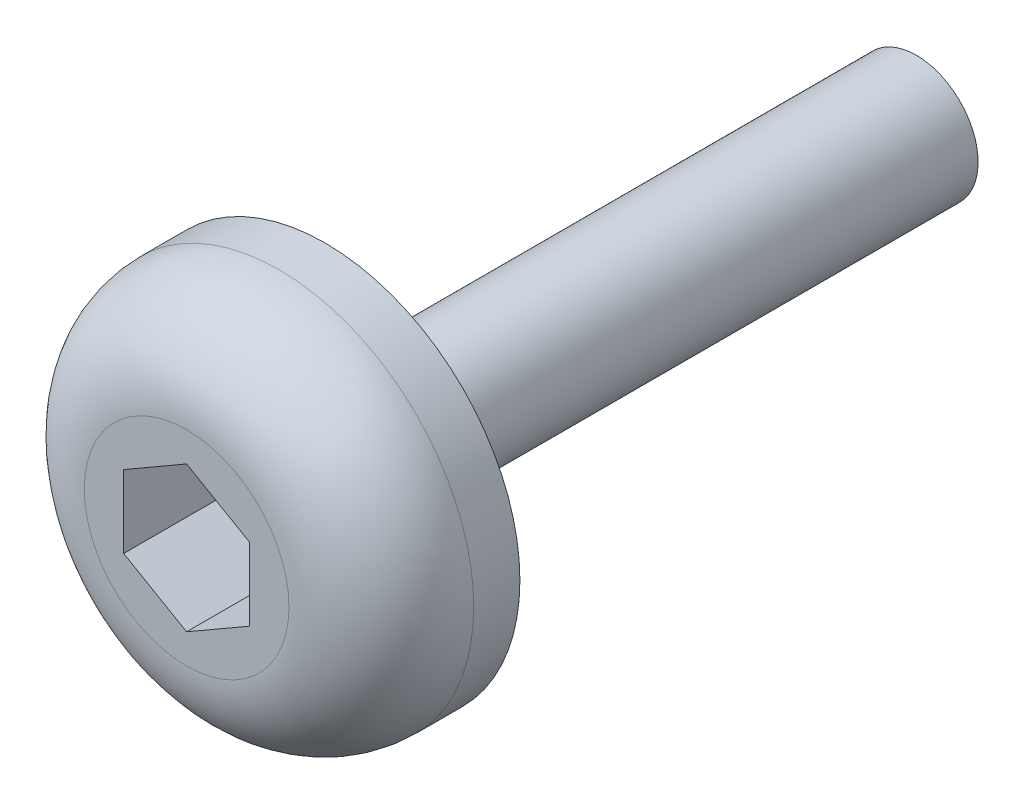
ISO-10303-21;
HEADER;
FILE_DESCRIPTION(('STEP AP214'),'2;1');
FILE_NAME('part.step','',(''),(''),'','','');
FILE_SCHEMA(('AUTOMOTIVE_DESIGN { 1 0 10303 214 1 1 1 1 }'));
ENDSEC;
DATA;
#1=APPLICATION_CONTEXT('core data for automotive mechanical design processes');
#2=APPLICATION_PROTOCOL_DEFINITION('international standard','automotive_design',2000,#1);
#3=PRODUCT_CONTEXT('',#1,'mechanical');
#4=PRODUCT('Part','Part','',(#3));
#5=PRODUCT_RELATED_PRODUCT_CATEGORY('part','',(#4));
#6=PRODUCT_DEFINITION_FORMATION('','',#4);
#7=PRODUCT_DEFINITION_CONTEXT('part definition',#1,'design');
#8=PRODUCT_DEFINITION('design','',#6,#7);
#9=PRODUCT_DEFINITION_SHAPE('','',#8);
#10=(LENGTH_UNIT() NAMED_UNIT(*) SI_UNIT(.MILLI.,.METRE.));
#11=(NAMED_UNIT(*) PLANE_ANGLE_UNIT() SI_UNIT($,.RADIAN.));
#12=(NAMED_UNIT(*) SI_UNIT($,.STERADIAN.) SOLID_ANGLE_UNIT());
#13=UNCERTAINTY_MEASURE_WITH_UNIT(LENGTH_MEASURE(1.E-05),#10,'distance_accuracy_value','');
#14=(GEOMETRIC_REPRESENTATION_CONTEXT(3) GLOBAL_UNCERTAINTY_ASSIGNED_CONTEXT((#13)) GLOBAL_UNIT_ASSIGNED_CONTEXT((#10,
#11,#12)) REPRESENTATION_CONTEXT('',''));
#15=CARTESIAN_POINT('',(0.,0.,0.));
#16=DIRECTION('',(0.,0.,1.));
#17=DIRECTION('',(1.,0.,0.));
#18=AXIS2_PLACEMENT_3D('',#15,#16,#17);
#19=CARTESIAN_POINT('',(0.,0.,3.81));
#20=DIRECTION('',(0.,0.,-1.));
#21=DIRECTION('',(-1.,0.,0.));
#22=AXIS2_PLACEMENT_3D('',#19,#20,#21);
#23=CYLINDRICAL_SURFACE('',#22,5.35434108198085);
#24=CARTESIAN_POINT('',(0.,0.,1.27));
#25=DIRECTION('',(0.,0.,1.));
#26=DIRECTION('',(1.,0.,0.));
#27=AXIS2_PLACEMENT_3D('',#24,#25,#26);
#28=CIRCLE('',#27,5.35434108198085);
#29=CARTESIAN_POINT('',(5.35434108198085,0.,1.27));
#30=VERTEX_POINT('',#29);
#31=EDGE_CURVE('E38',#30,#30,#28,.F.);
#32=ORIENTED_EDGE('',*,*,#31,.T.);
#33=EDGE_LOOP('',(#32));
#34=FACE_BOUND('',#33,.T.);
#35=CARTESIAN_POINT('',(0.,0.,0.));
#36=DIRECTION('',(0.,0.,1.));
#37=DIRECTION('',(1.,0.,0.));
#38=AXIS2_PLACEMENT_3D('',#35,#36,#37);
#39=CIRCLE('',#38,5.35434108198085);
#40=CARTESIAN_POINT('',(5.35434108198085,0.,0.));
#41=VERTEX_POINT('',#40);
#42=EDGE_CURVE('E138',#41,#41,#39,.T.);
#43=ORIENTED_EDGE('',*,*,#42,.T.);
#44=EDGE_LOOP('',(#43));
#45=FACE_BOUND('',#44,.T.);
#46=ADVANCED_FACE('F34',(#34,#45),#23,.T.);
#47=CARTESIAN_POINT('',(0.,0.,3.81));
#48=DIRECTION('',(0.,0.,1.));
#49=DIRECTION('',(1.,0.,0.));
#50=AXIS2_PLACEMENT_3D('',#47,#48,#49);
#51=PLANE('',#50);
#52=DIRECTION('',(-0.866025403784442,0.499999999999995,0.));
#53=VECTOR('',#52,1.);
#54=CARTESIAN_POINT('',(1.73058148496418,0.999151686198679,3.81));
#55=LINE('',#54,#53);
#56=CARTESIAN_POINT('',(1.73058148496418,0.999151686198679,3.81));
#57=VERTEX_POINT('',#56);
#58=CARTESIAN_POINT('',(0.,1.99830337239732,3.81));
#59=VERTEX_POINT('',#58);
#60=EDGE_CURVE('E50',#57,#59,#55,.T.);
#61=ORIENTED_EDGE('',*,*,#60,.F.);
#62=DIRECTION('',(0.,1.,0.));
#63=VECTOR('',#62,1.);
#64=CARTESIAN_POINT('',(1.7305814849642,-0.999151686198643,3.81));
#65=LINE('',#64,#63);
#66=CARTESIAN_POINT('',(1.7305814849642,-0.999151686198643,3.81));
#67=VERTEX_POINT('',#66);
#68=EDGE_CURVE('E134',#67,#57,#65,.T.);
#69=ORIENTED_EDGE('',*,*,#68,.F.);
#70=DIRECTION('',(0.866025403784434,0.500000000000007,0.));
#71=VECTOR('',#70,1.);
#72=CARTESIAN_POINT('',(0.,-1.99830337239732,3.81));
#73=LINE('',#72,#71);
#74=CARTESIAN_POINT('',(0.,-1.99830337239732,3.81));
#75=VERTEX_POINT('',#74);
#76=EDGE_CURVE('E132',#75,#67,#73,.T.);
#77=ORIENTED_EDGE('',*,*,#76,.F.);
#78=DIRECTION('',(0.866025403784442,-0.499999999999995,0.));
#79=VECTOR('',#78,1.);
#80=CARTESIAN_POINT('',(-1.73058148496419,-0.999151686198667,3.81));
#81=LINE('',#80,#79);
#82=CARTESIAN_POINT('',(-1.73058148496419,-0.999151686198667,3.81));
#83=VERTEX_POINT('',#82);
#84=EDGE_CURVE('E98',#83,#75,#81,.T.);
#85=ORIENTED_EDGE('',*,*,#84,.F.);
#86=DIRECTION('',(0.,-1.,0.));
#87=VECTOR('',#86,1.);
#88=CARTESIAN_POINT('',(-1.7305814849642,0.999151686198655,3.81));
#89=LINE('',#88,#87);
#90=CARTESIAN_POINT('',(-1.7305814849642,0.999151686198655,3.81));
#91=VERTEX_POINT('',#90);
#92=EDGE_CURVE('E128',#91,#83,#89,.T.);
#93=ORIENTED_EDGE('',*,*,#92,.F.);
#94=DIRECTION('',(-0.866025403784438,-0.500000000000001,0.));
#95=VECTOR('',#94,1.);
#96=CARTESIAN_POINT('',(0.,1.99830337239732,3.81));
#97=LINE('',#96,#95);
#98=EDGE_CURVE('E124',#59,#91,#97,.T.);
#99=ORIENTED_EDGE('',*,*,#98,.F.);
#100=EDGE_LOOP('',(#61,#69,#77,#85,#93,#99));
#101=FACE_BOUND('',#100,.T.);
#102=CARTESIAN_POINT('',(0.,0.,3.81));
#103=DIRECTION('',(0.,0.,1.));
#104=DIRECTION('',(1.,0.,0.));
#105=AXIS2_PLACEMENT_3D('',#102,#103,#104);
#106=CIRCLE('',#105,2.81434108198085);
#107=CARTESIAN_POINT('',(2.81434108198085,0.,3.81));
#108=VERTEX_POINT('',#107);
#109=EDGE_CURVE('E145',#108,#108,#106,.T.);
#110=ORIENTED_EDGE('',*,*,#109,.T.);
#111=EDGE_LOOP('',(#110));
#112=FACE_BOUND('',#111,.T.);
#113=ADVANCED_FACE('F164',(#101,#112),#51,.T.);
#114=CARTESIAN_POINT('',(0.,0.,0.));
#115=DIRECTION('',(0.,0.,1.));
#116=DIRECTION('',(1.,0.,0.));
#117=AXIS2_PLACEMENT_3D('',#114,#115,#116);
#118=PLANE('',#117);
#119=CARTESIAN_POINT('',(0.,0.,0.));
#120=DIRECTION('',(0.,0.,-1.));
#121=DIRECTION('',(-1.,0.,0.));
#122=AXIS2_PLACEMENT_3D('',#119,#120,#121);
#123=CIRCLE('',#122,1.69700590966187);
#124=CARTESIAN_POINT('',(-1.69700590966187,0.,0.));
#125=VERTEX_POINT('',#124);
#126=EDGE_CURVE('E11',#125,#125,#123,.T.);
#127=ORIENTED_EDGE('',*,*,#126,.F.);
#128=EDGE_LOOP('',(#127));
#129=FACE_BOUND('',#128,.T.);
#130=ORIENTED_EDGE('',*,*,#42,.F.);
#131=EDGE_LOOP('',(#130));
#132=FACE_BOUND('',#131,.T.);
#133=ADVANCED_FACE('F157',(#129,#132),#118,.F.);
#134=CARTESIAN_POINT('',(0.,0.,1.27));
#135=DIRECTION('',(0.,0.,1.));
#136=DIRECTION('',(1.,0.,0.));
#137=AXIS2_PLACEMENT_3D('',#134,#135,#136);
#138=TOROIDAL_SURFACE('',#137,2.81434108198085,2.54);
#139=ORIENTED_EDGE('',*,*,#31,.F.);
#140=EDGE_LOOP('',(#139));
#141=FACE_BOUND('',#140,.T.);
#142=ORIENTED_EDGE('',*,*,#109,.F.);
#143=EDGE_LOOP('',(#142));
#144=FACE_BOUND('',#143,.T.);
#145=ADVANCED_FACE('F36',(#141,#144),#138,.T.);
#146=CARTESIAN_POINT('',(1.73058148496418,0.999151686198679,1.016));
#147=DIRECTION('',(0.499999999999995,0.866025403784441,0.));
#148=DIRECTION('',(-0.866025403784441,0.499999999999995,0.));
#149=AXIS2_PLACEMENT_3D('',#146,#147,#148);
#150=PLANE('',#149);
#151=ORIENTED_EDGE('',*,*,#60,.T.);
#152=DIRECTION('',(0.,0.,1.));
#153=VECTOR('',#152,1.);
#154=CARTESIAN_POINT('',(0.,1.99830337239732,1.016));
#155=LINE('',#154,#153);
#156=CARTESIAN_POINT('',(0.,1.99830337239732,1.016));
#157=VERTEX_POINT('',#156);
#158=EDGE_CURVE('E80',#157,#59,#155,.T.);
#159=ORIENTED_EDGE('',*,*,#158,.F.);
#160=DIRECTION('',(-0.866025403784442,0.499999999999995,0.));
#161=VECTOR('',#160,1.);
#162=CARTESIAN_POINT('',(1.73058148496418,0.999151686198679,1.016));
#163=LINE('',#162,#161);
#164=CARTESIAN_POINT('',(1.73058148496418,0.999151686198679,1.016));
#165=VERTEX_POINT('',#164);
#166=EDGE_CURVE('E136',#165,#157,#163,.T.);
#167=ORIENTED_EDGE('',*,*,#166,.F.);
#168=DIRECTION('',(0.,0.,1.));
#169=VECTOR('',#168,1.);
#170=CARTESIAN_POINT('',(1.73058148496418,0.999151686198679,1.016));
#171=LINE('',#170,#169);
#172=EDGE_CURVE('E58',#165,#57,#171,.T.);
#173=ORIENTED_EDGE('',*,*,#172,.T.);
#174=EDGE_LOOP('',(#151,#159,#167,#173));
#175=FACE_BOUND('',#174,.T.);
#176=ADVANCED_FACE('F156',(#175),#150,.F.);
#177=CARTESIAN_POINT('',(1.7305814849642,-0.999151686198643,1.016));
#178=DIRECTION('',(1.,0.,0.));
#179=DIRECTION('',(0.,1.,0.));
#180=AXIS2_PLACEMENT_3D('',#177,#178,#179);
#181=PLANE('',#180);
#182=ORIENTED_EDGE('',*,*,#68,.T.);
#183=ORIENTED_EDGE('',*,*,#172,.F.);
#184=DIRECTION('',(0.,1.,0.));
#185=VECTOR('',#184,1.);
#186=CARTESIAN_POINT('',(1.7305814849642,-0.999151686198643,1.016));
#187=LINE('',#186,#185);
#188=CARTESIAN_POINT('',(1.7305814849642,-0.999151686198643,1.016));
#189=VERTEX_POINT('',#188);
#190=EDGE_CURVE('E110',#189,#165,#187,.T.);
#191=ORIENTED_EDGE('',*,*,#190,.F.);
#192=DIRECTION('',(0.,0.,1.));
#193=VECTOR('',#192,1.);
#194=CARTESIAN_POINT('',(1.7305814849642,-0.999151686198643,1.016));
#195=LINE('',#194,#193);
#196=EDGE_CURVE('E102',#189,#67,#195,.T.);
#197=ORIENTED_EDGE('',*,*,#196,.T.);
#198=EDGE_LOOP('',(#182,#183,#191,#197));
#199=FACE_BOUND('',#198,.T.);
#200=ADVANCED_FACE('F162',(#199),#181,.F.);
#201=CARTESIAN_POINT('',(0.,-1.99830337239732,1.016));
#202=DIRECTION('',(0.500000000000007,-0.866025403784435,0.));
#203=DIRECTION('',(0.866025403784435,0.500000000000007,0.));
#204=AXIS2_PLACEMENT_3D('',#201,#202,#203);
#205=PLANE('',#204);
#206=ORIENTED_EDGE('',*,*,#76,.T.);
#207=ORIENTED_EDGE('',*,*,#196,.F.);
#208=DIRECTION('',(0.866025403784434,0.500000000000007,0.));
#209=VECTOR('',#208,1.);
#210=CARTESIAN_POINT('',(0.,-1.99830337239732,1.016));
#211=LINE('',#210,#209);
#212=CARTESIAN_POINT('',(0.,-1.99830337239732,1.016));
#213=VERTEX_POINT('',#212);
#214=EDGE_CURVE('E106',#213,#189,#211,.T.);
#215=ORIENTED_EDGE('',*,*,#214,.F.);
#216=DIRECTION('',(0.,0.,1.));
#217=VECTOR('',#216,1.);
#218=CARTESIAN_POINT('',(0.,-1.99830337239732,1.016));
#219=LINE('',#218,#217);
#220=EDGE_CURVE('E91',#213,#75,#219,.T.);
#221=ORIENTED_EDGE('',*,*,#220,.T.);
#222=EDGE_LOOP('',(#206,#207,#215,#221));
#223=FACE_BOUND('',#222,.T.);
#224=ADVANCED_FACE('F107',(#223),#205,.F.);
#225=CARTESIAN_POINT('',(-1.73058148496419,-0.999151686198667,1.016));
#226=DIRECTION('',(-0.499999999999995,-0.866025403784442,0.));
#227=DIRECTION('',(0.866025403784442,-0.499999999999995,0.));
#228=AXIS2_PLACEMENT_3D('',#225,#226,#227);
#229=PLANE('',#228);
#230=ORIENTED_EDGE('',*,*,#84,.T.);
#231=ORIENTED_EDGE('',*,*,#220,.F.);
#232=DIRECTION('',(0.866025403784442,-0.499999999999995,0.));
#233=VECTOR('',#232,1.);
#234=CARTESIAN_POINT('',(-1.73058148496419,-0.999151686198667,1.016));
#235=LINE('',#234,#233);
#236=CARTESIAN_POINT('',(-1.73058148496419,-0.999151686198667,1.016));
#237=VERTEX_POINT('',#236);
#238=EDGE_CURVE('E95',#237,#213,#235,.T.);
#239=ORIENTED_EDGE('',*,*,#238,.F.);
#240=DIRECTION('',(0.,0.,1.));
#241=VECTOR('',#240,1.);
#242=CARTESIAN_POINT('',(-1.73058148496419,-0.999151686198667,1.016));
#243=LINE('',#242,#241);
#244=EDGE_CURVE('E103',#237,#83,#243,.T.);
#245=ORIENTED_EDGE('',*,*,#244,.T.);
#246=EDGE_LOOP('',(#230,#231,#239,#245));
#247=FACE_BOUND('',#246,.T.);
#248=ADVANCED_FACE('F93',(#247),#229,.F.);
#249=CARTESIAN_POINT('',(-1.7305814849642,0.999151686198655,1.016));
#250=DIRECTION('',(-1.,0.,0.));
#251=DIRECTION('',(0.,-1.,0.));
#252=AXIS2_PLACEMENT_3D('',#249,#250,#251);
#253=PLANE('',#252);
#254=ORIENTED_EDGE('',*,*,#92,.T.);
#255=ORIENTED_EDGE('',*,*,#244,.F.);
#256=DIRECTION('',(0.,-1.,0.));
#257=VECTOR('',#256,1.);
#258=CARTESIAN_POINT('',(-1.7305814849642,0.999151686198655,1.016));
#259=LINE('',#258,#257);
#260=CARTESIAN_POINT('',(-1.7305814849642,0.999151686198655,1.016));
#261=VERTEX_POINT('',#260);
#262=EDGE_CURVE('E116',#261,#237,#259,.T.);
#263=ORIENTED_EDGE('',*,*,#262,.F.);
#264=DIRECTION('',(0.,0.,1.));
#265=VECTOR('',#264,1.);
#266=CARTESIAN_POINT('',(-1.7305814849642,0.999151686198655,1.016));
#267=LINE('',#266,#265);
#268=EDGE_CURVE('E141',#261,#91,#267,.T.);
#269=ORIENTED_EDGE('',*,*,#268,.T.);
#270=EDGE_LOOP('',(#254,#255,#263,#269));
#271=FACE_BOUND('',#270,.T.);
#272=ADVANCED_FACE('F177',(#271),#253,.F.);
#273=CARTESIAN_POINT('',(0.,1.99830337239732,1.016));
#274=DIRECTION('',(-0.500000000000001,0.866025403784438,0.));
#275=DIRECTION('',(-0.866025403784438,-0.500000000000001,0.));
#276=AXIS2_PLACEMENT_3D('',#273,#274,#275);
#277=PLANE('',#276);
#278=ORIENTED_EDGE('',*,*,#98,.T.);
#279=ORIENTED_EDGE('',*,*,#268,.F.);
#280=DIRECTION('',(-0.866025403784438,-0.500000000000001,0.));
#281=VECTOR('',#280,1.);
#282=CARTESIAN_POINT('',(0.,1.99830337239732,1.016));
#283=LINE('',#282,#281);
#284=EDGE_CURVE('E118',#157,#261,#283,.T.);
#285=ORIENTED_EDGE('',*,*,#284,.F.);
#286=ORIENTED_EDGE('',*,*,#158,.T.);
#287=EDGE_LOOP('',(#278,#279,#285,#286));
#288=FACE_BOUND('',#287,.T.);
#289=ADVANCED_FACE('F174',(#288),#277,.F.);
#290=CARTESIAN_POINT('',(0.,0.,1.016));
#291=DIRECTION('',(0.,0.,1.));
#292=DIRECTION('',(1.,0.,0.));
#293=AXIS2_PLACEMENT_3D('',#290,#291,#292);
#294=PLANE('',#293);
#295=ORIENTED_EDGE('',*,*,#166,.T.);
#296=ORIENTED_EDGE('',*,*,#284,.T.);
#297=ORIENTED_EDGE('',*,*,#262,.T.);
#298=ORIENTED_EDGE('',*,*,#238,.T.);
#299=ORIENTED_EDGE('',*,*,#214,.T.);
#300=ORIENTED_EDGE('',*,*,#190,.T.);
#301=EDGE_LOOP('',(#295,#296,#297,#298,#299,#300));
#302=FACE_BOUND('',#301,.T.);
#303=ADVANCED_FACE('F113',(#302),#294,.T.);
#304=CARTESIAN_POINT('',(0.,0.,-16.256));
#305=DIRECTION('',(0.,0.,1.));
#306=DIRECTION('',(1.,0.,0.));
#307=AXIS2_PLACEMENT_3D('',#304,#305,#306);
#308=CYLINDRICAL_SURFACE('',#307,1.69700590966187);
#309=CARTESIAN_POINT('',(0.,0.,-16.256));
#310=DIRECTION('',(0.,0.,-1.));
#311=DIRECTION('',(-1.,0.,0.));
#312=AXIS2_PLACEMENT_3D('',#309,#310,#311);
#313=CIRCLE('',#312,1.69700590966187);
#314=CARTESIAN_POINT('',(-1.69700590966187,0.,-16.256));
#315=VERTEX_POINT('',#314);
#316=EDGE_CURVE('E125',#315,#315,#313,.T.);
#317=ORIENTED_EDGE('',*,*,#316,.F.);
#318=EDGE_LOOP('',(#317));
#319=FACE_BOUND('',#318,.T.);
#320=ORIENTED_EDGE('',*,*,#126,.T.);
#321=EDGE_LOOP('',(#320));
#322=FACE_BOUND('',#321,.T.);
#323=ADVANCED_FACE('F190',(#319,#322),#308,.T.);
#324=CARTESIAN_POINT('',(0.,0.,-16.256));
#325=DIRECTION('',(0.,0.,-1.));
#326=DIRECTION('',(-1.,0.,0.));
#327=AXIS2_PLACEMENT_3D('',#324,#325,#326);
#328=PLANE('',#327);
#329=ORIENTED_EDGE('',*,*,#316,.T.);
#330=EDGE_LOOP('',(#329));
#331=FACE_BOUND('',#330,.T.);
#332=ADVANCED_FACE('F193',(#331),#328,.T.);
#333=CLOSED_SHELL('',(#46,#113,#133,#145,#176,#200,#224,#248,#272,#289,#303,#323,#332));
#334=MANIFOLD_SOLID_BREP('B2',#333);
#335=ADVANCED_BREP_SHAPE_REPRESENTATION('',(#18,#334),#14);
#336=SHAPE_DEFINITION_REPRESENTATION(#9,#335);
ENDSEC;
END-ISO-10303-21;
